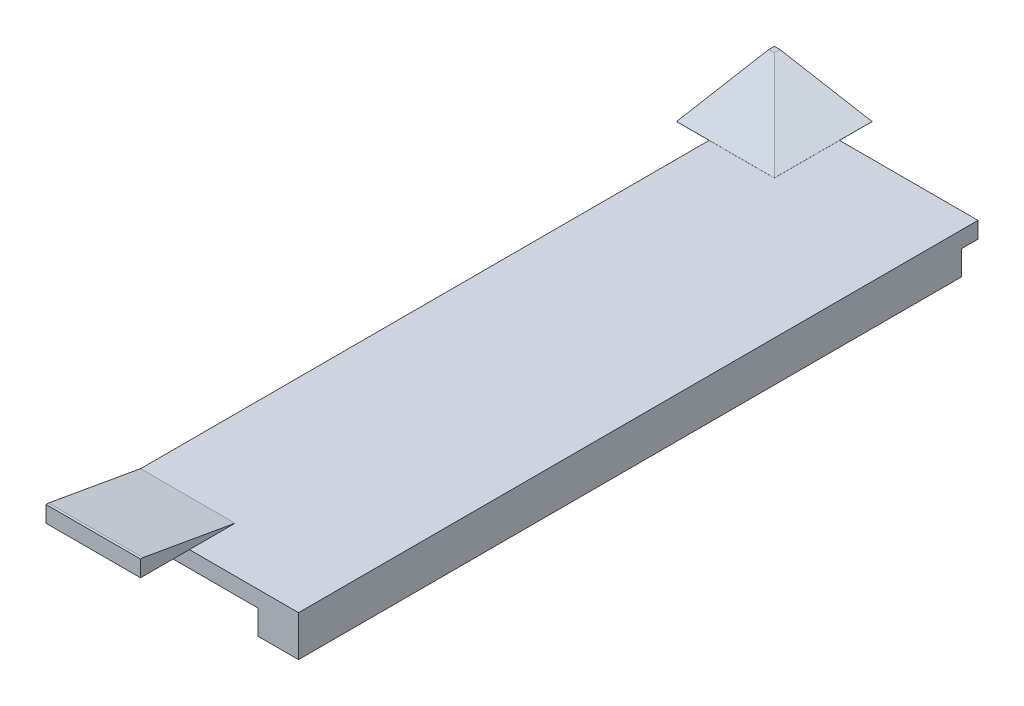
ISO-10303-21;
HEADER;
FILE_DESCRIPTION(('STEP AP214'),'2;1');
FILE_NAME('part.step','',(''),(''),'','','');
FILE_SCHEMA(('AUTOMOTIVE_DESIGN { 1 0 10303 214 1 1 1 1 }'));
ENDSEC;
DATA;
#1=APPLICATION_CONTEXT('core data for automotive mechanical design processes');
#2=APPLICATION_PROTOCOL_DEFINITION('international standard','automotive_design',2000,#1);
#3=PRODUCT_CONTEXT('',#1,'mechanical');
#4=PRODUCT('Part','Part','',(#3));
#5=PRODUCT_RELATED_PRODUCT_CATEGORY('part','',(#4));
#6=PRODUCT_DEFINITION_FORMATION('','',#4);
#7=PRODUCT_DEFINITION_CONTEXT('part definition',#1,'design');
#8=PRODUCT_DEFINITION('design','',#6,#7);
#9=PRODUCT_DEFINITION_SHAPE('','',#8);
#10=(LENGTH_UNIT() NAMED_UNIT(*) SI_UNIT(.MILLI.,.METRE.));
#11=(NAMED_UNIT(*) PLANE_ANGLE_UNIT() SI_UNIT($,.RADIAN.));
#12=(NAMED_UNIT(*) SI_UNIT($,.STERADIAN.) SOLID_ANGLE_UNIT());
#13=UNCERTAINTY_MEASURE_WITH_UNIT(LENGTH_MEASURE(1.E-05),#10,'distance_accuracy_value','');
#14=(GEOMETRIC_REPRESENTATION_CONTEXT(3) GLOBAL_UNCERTAINTY_ASSIGNED_CONTEXT((#13)) GLOBAL_UNIT_ASSIGNED_CONTEXT((#10,
#11,#12)) REPRESENTATION_CONTEXT('',''));
#15=CARTESIAN_POINT('',(0.,0.,0.));
#16=DIRECTION('',(0.,0.,1.));
#17=DIRECTION('',(1.,0.,0.));
#18=AXIS2_PLACEMENT_3D('',#15,#16,#17);
#19=CARTESIAN_POINT('',(0.,2.,0.));
#20=DIRECTION('',(0.,-1.,0.));
#21=DIRECTION('',(0.,0.,-1.));
#22=AXIS2_PLACEMENT_3D('',#19,#20,#21);
#23=PLANE('',#22);
#24=DIRECTION('',(0.,0.,-1.));
#25=VECTOR('',#24,1.);
#26=CARTESIAN_POINT('',(8.,2.,-75.4));
#27=LINE('',#26,#25);
#28=CARTESIAN_POINT('',(8.,2.,-75.4));
#29=VERTEX_POINT('',#28);
#30=CARTESIAN_POINT('',(8.,2.,-83.4));
#31=VERTEX_POINT('',#30);
#32=EDGE_CURVE('E260',#29,#31,#27,.T.);
#33=ORIENTED_EDGE('',*,*,#32,.F.);
#34=DIRECTION('',(1.,0.,0.));
#35=VECTOR('',#34,1.);
#36=CARTESIAN_POINT('',(8.,2.,-75.4));
#37=LINE('',#36,#35);
#38=CARTESIAN_POINT('',(0.,2.,-75.4));
#39=VERTEX_POINT('',#38);
#40=EDGE_CURVE('E252',#39,#29,#37,.T.);
#41=ORIENTED_EDGE('',*,*,#40,.F.);
#42=DIRECTION('',(0.,0.,1.));
#43=VECTOR('',#42,1.);
#44=CARTESIAN_POINT('',(0.,2.,0.));
#45=LINE('',#44,#43);
#46=CARTESIAN_POINT('',(0.,2.,-5.6));
#47=VERTEX_POINT('',#46);
#48=EDGE_CURVE('E315',#39,#47,#45,.T.);
#49=ORIENTED_EDGE('',*,*,#48,.T.);
#50=DIRECTION('',(-1.,0.,0.));
#51=VECTOR('',#50,1.);
#52=CARTESIAN_POINT('',(0.,2.,-5.59999999999999));
#53=LINE('',#52,#51);
#54=CARTESIAN_POINT('',(11.6,2.,-5.6));
#55=VERTEX_POINT('',#54);
#56=EDGE_CURVE('E275',#55,#47,#53,.T.);
#57=ORIENTED_EDGE('',*,*,#56,.F.);
#58=DIRECTION('',(0.,0.,-1.));
#59=VECTOR('',#58,1.);
#60=CARTESIAN_POINT('',(11.6,2.,-5.6));
#61=LINE('',#60,#59);
#62=CARTESIAN_POINT('',(11.6,2.,0.));
#63=VERTEX_POINT('',#62);
#64=EDGE_CURVE('E292',#63,#55,#61,.T.);
#65=ORIENTED_EDGE('',*,*,#64,.F.);
#66=DIRECTION('',(1.,0.,0.));
#67=VECTOR('',#66,1.);
#68=CARTESIAN_POINT('',(0.,2.,0.));
#69=LINE('',#68,#67);
#70=CARTESIAN_POINT('',(25.,2.,0.));
#71=VERTEX_POINT('',#70);
#72=EDGE_CURVE('E314',#63,#71,#69,.T.);
#73=ORIENTED_EDGE('',*,*,#72,.T.);
#74=DIRECTION('',(0.,0.,-1.));
#75=VECTOR('',#74,1.);
#76=CARTESIAN_POINT('',(25.,2.,0.));
#77=LINE('',#76,#75);
#78=CARTESIAN_POINT('',(25.,2.,-83.4));
#79=VERTEX_POINT('',#78);
#80=EDGE_CURVE('E191',#71,#79,#77,.T.);
#81=ORIENTED_EDGE('',*,*,#80,.T.);
#82=DIRECTION('',(-1.,0.,0.));
#83=VECTOR('',#82,1.);
#84=CARTESIAN_POINT('',(0.,2.,-83.4));
#85=LINE('',#84,#83);
#86=EDGE_CURVE('E323',#79,#31,#85,.T.);
#87=ORIENTED_EDGE('',*,*,#86,.T.);
#88=EDGE_LOOP('',(#33,#41,#49,#57,#65,#73,#81,#87));
#89=FACE_BOUND('',#88,.T.);
#90=ADVANCED_FACE('F51',(#89),#23,.F.);
#91=CARTESIAN_POINT('',(0.,2.,0.));
#92=DIRECTION('',(1.,0.,0.));
#93=DIRECTION('',(0.,0.,-1.));
#94=AXIS2_PLACEMENT_3D('',#91,#92,#93);
#95=PLANE('',#94);
#96=DIRECTION('',(0.,0.,1.));
#97=VECTOR('',#96,1.);
#98=CARTESIAN_POINT('',(0.,4.,-5.59999999999999));
#99=LINE('',#98,#97);
#100=CARTESIAN_POINT('',(0.,4.,5.70000000000023));
#101=VERTEX_POINT('',#100);
#102=CARTESIAN_POINT('',(0.,4.,6.));
#103=VERTEX_POINT('',#102);
#104=EDGE_CURVE('E271',#101,#103,#99,.T.);
#105=ORIENTED_EDGE('',*,*,#104,.F.);
#106=DIRECTION('',(0.,-0.173648177666927,-0.984807753012209));
#107=VECTOR('',#106,1.);
#108=CARTESIAN_POINT('',(0.,4.,5.70000000000023));
#109=LINE('',#108,#107);
#110=CARTESIAN_POINT('',(0.,2.00750511799434,-5.59999999999999));
#111=VERTEX_POINT('',#110);
#112=EDGE_CURVE('E371',#101,#111,#109,.T.);
#113=ORIENTED_EDGE('',*,*,#112,.T.);
#114=DIRECTION('',(0.,-1.,0.));
#115=VECTOR('',#114,1.);
#116=CARTESIAN_POINT('',(0.,4.,-5.59999999999999));
#117=LINE('',#116,#115);
#118=EDGE_CURVE('E282',#111,#47,#117,.T.);
#119=ORIENTED_EDGE('',*,*,#118,.T.);
#120=ORIENTED_EDGE('',*,*,#48,.F.);
#121=CARTESIAN_POINT('',(0.,2.,-83.4));
#122=VERTEX_POINT('',#121);
#123=EDGE_CURVE('E310',#122,#39,#45,.T.);
#124=ORIENTED_EDGE('',*,*,#123,.F.);
#125=DIRECTION('',(0.,-1.,0.));
#126=VECTOR('',#125,1.);
#127=CARTESIAN_POINT('',(0.,2.,-83.4));
#128=LINE('',#127,#126);
#129=CARTESIAN_POINT('',(0.,0.,-83.4));
#130=VERTEX_POINT('',#129);
#131=EDGE_CURVE('E327',#122,#130,#128,.T.);
#132=ORIENTED_EDGE('',*,*,#131,.T.);
#133=DIRECTION('',(0.,0.,1.));
#134=VECTOR('',#133,1.);
#135=CARTESIAN_POINT('',(0.,0.,0.));
#136=LINE('',#135,#134);
#137=CARTESIAN_POINT('',(0.,0.,0.));
#138=VERTEX_POINT('',#137);
#139=EDGE_CURVE('E309',#130,#138,#136,.T.);
#140=ORIENTED_EDGE('',*,*,#139,.T.);
#141=DIRECTION('',(0.,-1.,0.));
#142=VECTOR('',#141,1.);
#143=CARTESIAN_POINT('',(0.,2.,0.));
#144=LINE('',#143,#142);
#145=CARTESIAN_POINT('',(0.,2.,0.));
#146=VERTEX_POINT('',#145);
#147=EDGE_CURVE('E195',#146,#138,#144,.T.);
#148=ORIENTED_EDGE('',*,*,#147,.F.);
#149=DIRECTION('',(0.,0.,1.));
#150=VECTOR('',#149,1.);
#151=CARTESIAN_POINT('',(0.,2.,-5.59999999999999));
#152=LINE('',#151,#150);
#153=CARTESIAN_POINT('',(0.,2.,6.));
#154=VERTEX_POINT('',#153);
#155=EDGE_CURVE('E264',#146,#154,#152,.T.);
#156=ORIENTED_EDGE('',*,*,#155,.T.);
#157=DIRECTION('',(0.,-1.,0.));
#158=VECTOR('',#157,1.);
#159=CARTESIAN_POINT('',(0.,4.,6.));
#160=LINE('',#159,#158);
#161=EDGE_CURVE('E305',#103,#154,#160,.T.);
#162=ORIENTED_EDGE('',*,*,#161,.F.);
#163=EDGE_LOOP('',(#105,#113,#119,#120,#124,#132,#140,#148,#156,#162));
#164=FACE_BOUND('',#163,.T.);
#165=ADVANCED_FACE('F394',(#164),#95,.F.);
#166=CARTESIAN_POINT('',(0.,2.,0.));
#167=DIRECTION('',(0.,0.,-1.));
#168=DIRECTION('',(-1.,0.,0.));
#169=AXIS2_PLACEMENT_3D('',#166,#167,#168);
#170=PLANE('',#169);
#171=DIRECTION('',(1.,0.,0.));
#172=VECTOR('',#171,1.);
#173=CARTESIAN_POINT('',(0.,0.,0.));
#174=LINE('',#173,#172);
#175=CARTESIAN_POINT('',(20.,0.,0.));
#176=VERTEX_POINT('',#175);
#177=EDGE_CURVE('E331',#138,#176,#174,.T.);
#178=ORIENTED_EDGE('',*,*,#177,.T.);
#179=DIRECTION('',(0.,1.,0.));
#180=VECTOR('',#179,1.);
#181=CARTESIAN_POINT('',(20.,-3.,0.));
#182=LINE('',#181,#180);
#183=CARTESIAN_POINT('',(20.,-3.,0.));
#184=VERTEX_POINT('',#183);
#185=EDGE_CURVE('E202',#184,#176,#182,.T.);
#186=ORIENTED_EDGE('',*,*,#185,.F.);
#187=DIRECTION('',(-1.,0.,0.));
#188=VECTOR('',#187,1.);
#189=CARTESIAN_POINT('',(25.,-3.,0.));
#190=LINE('',#189,#188);
#191=CARTESIAN_POINT('',(25.,-3.,0.));
#192=VERTEX_POINT('',#191);
#193=EDGE_CURVE('E199',#192,#184,#190,.T.);
#194=ORIENTED_EDGE('',*,*,#193,.F.);
#195=DIRECTION('',(0.,-1.,0.));
#196=VECTOR('',#195,1.);
#197=CARTESIAN_POINT('',(25.,2.,0.));
#198=LINE('',#197,#196);
#199=EDGE_CURVE('E184',#71,#192,#198,.T.);
#200=ORIENTED_EDGE('',*,*,#199,.F.);
#201=ORIENTED_EDGE('',*,*,#72,.F.);
#202=EDGE_CURVE('E316',#146,#63,#69,.T.);
#203=ORIENTED_EDGE('',*,*,#202,.F.);
#204=ORIENTED_EDGE('',*,*,#147,.T.);
#205=EDGE_LOOP('',(#178,#186,#194,#200,#201,#203,#204));
#206=FACE_BOUND('',#205,.T.);
#207=ADVANCED_FACE('F200',(#206),#170,.F.);
#208=CARTESIAN_POINT('',(25.,2.,0.));
#209=DIRECTION('',(-1.,0.,0.));
#210=DIRECTION('',(0.,0.,1.));
#211=AXIS2_PLACEMENT_3D('',#208,#209,#210);
#212=PLANE('',#211);
#213=ORIENTED_EDGE('',*,*,#199,.T.);
#214=DIRECTION('',(0.,0.,1.));
#215=VECTOR('',#214,1.);
#216=CARTESIAN_POINT('',(25.,-3.,-81.4));
#217=LINE('',#216,#215);
#218=CARTESIAN_POINT('',(25.,-3.,-81.4));
#219=VERTEX_POINT('',#218);
#220=EDGE_CURVE('E189',#219,#192,#217,.T.);
#221=ORIENTED_EDGE('',*,*,#220,.F.);
#222=DIRECTION('',(0.,1.,0.));
#223=VECTOR('',#222,1.);
#224=CARTESIAN_POINT('',(25.,-3.,-81.4));
#225=LINE('',#224,#223);
#226=CARTESIAN_POINT('',(25.,0.,-81.4));
#227=VERTEX_POINT('',#226);
#228=EDGE_CURVE('E222',#219,#227,#225,.T.);
#229=ORIENTED_EDGE('',*,*,#228,.T.);
#230=DIRECTION('',(0.,0.,-1.));
#231=VECTOR('',#230,1.);
#232=CARTESIAN_POINT('',(25.,0.,0.));
#233=LINE('',#232,#231);
#234=CARTESIAN_POINT('',(25.,0.,-83.4));
#235=VERTEX_POINT('',#234);
#236=EDGE_CURVE('E75',#227,#235,#233,.T.);
#237=ORIENTED_EDGE('',*,*,#236,.T.);
#238=DIRECTION('',(0.,-1.,0.));
#239=VECTOR('',#238,1.);
#240=CARTESIAN_POINT('',(25.,2.,-83.4));
#241=LINE('',#240,#239);
#242=EDGE_CURVE('E196',#79,#235,#241,.T.);
#243=ORIENTED_EDGE('',*,*,#242,.F.);
#244=ORIENTED_EDGE('',*,*,#80,.F.);
#245=EDGE_LOOP('',(#213,#221,#229,#237,#243,#244));
#246=FACE_BOUND('',#245,.T.);
#247=ADVANCED_FACE('F186',(#246),#212,.F.);
#248=CARTESIAN_POINT('',(0.,2.,-83.4));
#249=DIRECTION('',(0.,0.,1.));
#250=DIRECTION('',(1.,0.,0.));
#251=AXIS2_PLACEMENT_3D('',#248,#249,#250);
#252=PLANE('',#251);
#253=DIRECTION('',(-1.,0.,0.));
#254=VECTOR('',#253,1.);
#255=CARTESIAN_POINT('',(0.,0.,-83.4));
#256=LINE('',#255,#254);
#257=EDGE_CURVE('E336',#235,#130,#256,.T.);
#258=ORIENTED_EDGE('',*,*,#257,.T.);
#259=ORIENTED_EDGE('',*,*,#131,.F.);
#260=EDGE_CURVE('E322',#31,#122,#85,.T.);
#261=ORIENTED_EDGE('',*,*,#260,.F.);
#262=ORIENTED_EDGE('',*,*,#86,.F.);
#263=ORIENTED_EDGE('',*,*,#242,.T.);
#264=EDGE_LOOP('',(#258,#259,#261,#262,#263));
#265=FACE_BOUND('',#264,.T.);
#266=ADVANCED_FACE('F414',(#265),#252,.F.);
#267=CARTESIAN_POINT('',(0.,0.,0.));
#268=DIRECTION('',(0.,-1.,0.));
#269=DIRECTION('',(0.,0.,-1.));
#270=AXIS2_PLACEMENT_3D('',#267,#268,#269);
#271=PLANE('',#270);
#272=DIRECTION('',(1.,0.,0.));
#273=VECTOR('',#272,1.);
#274=CARTESIAN_POINT('',(25.,0.,-81.4));
#275=LINE('',#274,#273);
#276=CARTESIAN_POINT('',(20.,0.,-81.4));
#277=VERTEX_POINT('',#276);
#278=EDGE_CURVE('E213',#277,#227,#275,.T.);
#279=ORIENTED_EDGE('',*,*,#278,.F.);
#280=DIRECTION('',(0.,0.,-1.));
#281=VECTOR('',#280,1.);
#282=CARTESIAN_POINT('',(20.,0.,-81.4));
#283=LINE('',#282,#281);
#284=EDGE_CURVE('E69',#176,#277,#283,.T.);
#285=ORIENTED_EDGE('',*,*,#284,.F.);
#286=ORIENTED_EDGE('',*,*,#177,.F.);
#287=ORIENTED_EDGE('',*,*,#139,.F.);
#288=ORIENTED_EDGE('',*,*,#257,.F.);
#289=ORIENTED_EDGE('',*,*,#236,.F.);
#290=EDGE_LOOP('',(#279,#285,#286,#287,#288,#289));
#291=FACE_BOUND('',#290,.T.);
#292=ADVANCED_FACE('F406',(#291),#271,.T.);
#293=CARTESIAN_POINT('',(0.,2.,0.));
#294=DIRECTION('',(0.,1.,0.));
#295=DIRECTION('',(0.,0.,1.));
#296=AXIS2_PLACEMENT_3D('',#293,#294,#295);
#297=PLANE('',#296);
#298=ORIENTED_EDGE('',*,*,#155,.F.);
#299=ORIENTED_EDGE('',*,*,#202,.T.);
#300=CARTESIAN_POINT('',(11.6,2.,6.));
#301=VERTEX_POINT('',#300);
#302=EDGE_CURVE('E288',#301,#63,#61,.T.);
#303=ORIENTED_EDGE('',*,*,#302,.F.);
#304=DIRECTION('',(1.,0.,0.));
#305=VECTOR('',#304,1.);
#306=CARTESIAN_POINT('',(0.,2.,6.));
#307=LINE('',#306,#305);
#308=EDGE_CURVE('E285',#154,#301,#307,.T.);
#309=ORIENTED_EDGE('',*,*,#308,.F.);
#310=EDGE_LOOP('',(#298,#299,#303,#309));
#311=FACE_BOUND('',#310,.T.);
#312=ADVANCED_FACE('F403',(#311),#297,.F.);
#313=CARTESIAN_POINT('',(0.,4.,6.));
#314=DIRECTION('',(0.,0.,-1.));
#315=DIRECTION('',(-1.,0.,0.));
#316=AXIS2_PLACEMENT_3D('',#313,#314,#315);
#317=PLANE('',#316);
#318=ORIENTED_EDGE('',*,*,#308,.T.);
#319=DIRECTION('',(0.,-1.,0.));
#320=VECTOR('',#319,1.);
#321=CARTESIAN_POINT('',(11.6,4.,6.));
#322=LINE('',#321,#320);
#323=CARTESIAN_POINT('',(11.6,4.,6.));
#324=VERTEX_POINT('',#323);
#325=EDGE_CURVE('E301',#324,#301,#322,.T.);
#326=ORIENTED_EDGE('',*,*,#325,.F.);
#327=DIRECTION('',(1.,0.,0.));
#328=VECTOR('',#327,1.);
#329=CARTESIAN_POINT('',(0.,4.,6.));
#330=LINE('',#329,#328);
#331=EDGE_CURVE('E274',#103,#324,#330,.T.);
#332=ORIENTED_EDGE('',*,*,#331,.F.);
#333=ORIENTED_EDGE('',*,*,#161,.T.);
#334=EDGE_LOOP('',(#318,#326,#332,#333));
#335=FACE_BOUND('',#334,.T.);
#336=ADVANCED_FACE('F399',(#335),#317,.F.);
#337=CARTESIAN_POINT('',(11.6,4.,-5.6));
#338=DIRECTION('',(-1.,0.,0.));
#339=DIRECTION('',(0.,0.,1.));
#340=AXIS2_PLACEMENT_3D('',#337,#338,#339);
#341=PLANE('',#340);
#342=DIRECTION('',(0.,-1.,0.));
#343=VECTOR('',#342,1.);
#344=CARTESIAN_POINT('',(11.6,4.,-5.6));
#345=LINE('',#344,#343);
#346=CARTESIAN_POINT('',(11.6,2.00750511799434,-5.6));
#347=VERTEX_POINT('',#346);
#348=EDGE_CURVE('E298',#347,#55,#345,.T.);
#349=ORIENTED_EDGE('',*,*,#348,.F.);
#350=DIRECTION('',(0.,0.173648177666927,0.984807753012209));
#351=VECTOR('',#350,1.);
#352=CARTESIAN_POINT('',(11.6,4.,5.70000000000023));
#353=LINE('',#352,#351);
#354=CARTESIAN_POINT('',(11.6,4.,5.70000000000023));
#355=VERTEX_POINT('',#354);
#356=EDGE_CURVE('E11',#347,#355,#353,.T.);
#357=ORIENTED_EDGE('',*,*,#356,.T.);
#358=DIRECTION('',(0.,0.,-1.));
#359=VECTOR('',#358,1.);
#360=CARTESIAN_POINT('',(11.6,4.,-5.6));
#361=LINE('',#360,#359);
#362=EDGE_CURVE('E278',#324,#355,#361,.T.);
#363=ORIENTED_EDGE('',*,*,#362,.F.);
#364=ORIENTED_EDGE('',*,*,#325,.T.);
#365=ORIENTED_EDGE('',*,*,#302,.T.);
#366=ORIENTED_EDGE('',*,*,#64,.T.);
#367=EDGE_LOOP('',(#349,#357,#363,#364,#365,#366));
#368=FACE_BOUND('',#367,.T.);
#369=ADVANCED_FACE('F385',(#368),#341,.F.);
#370=CARTESIAN_POINT('',(0.,4.,-5.59999999999999));
#371=DIRECTION('',(0.,0.,1.));
#372=DIRECTION('',(1.,0.,0.));
#373=AXIS2_PLACEMENT_3D('',#370,#371,#372);
#374=PLANE('',#373);
#375=ORIENTED_EDGE('',*,*,#118,.F.);
#376=DIRECTION('',(1.,0.,0.));
#377=VECTOR('',#376,1.);
#378=CARTESIAN_POINT('',(11.6,2.00750511799434,-5.6));
#379=LINE('',#378,#377);
#380=EDGE_CURVE('E62',#111,#347,#379,.T.);
#381=ORIENTED_EDGE('',*,*,#380,.T.);
#382=ORIENTED_EDGE('',*,*,#348,.T.);
#383=ORIENTED_EDGE('',*,*,#56,.T.);
#384=EDGE_LOOP('',(#375,#381,#382,#383));
#385=FACE_BOUND('',#384,.T.);
#386=ADVANCED_FACE('F379',(#385),#374,.F.);
#387=CARTESIAN_POINT('',(0.,4.,0.));
#388=DIRECTION('',(0.,1.,0.));
#389=DIRECTION('',(0.,0.,1.));
#390=AXIS2_PLACEMENT_3D('',#387,#388,#389);
#391=PLANE('',#390);
#392=ORIENTED_EDGE('',*,*,#362,.T.);
#393=DIRECTION('',(-1.,0.,0.));
#394=VECTOR('',#393,1.);
#395=CARTESIAN_POINT('',(0.,4.,5.70000000000023));
#396=LINE('',#395,#394);
#397=EDGE_CURVE('E367',#355,#101,#396,.T.);
#398=ORIENTED_EDGE('',*,*,#397,.T.);
#399=ORIENTED_EDGE('',*,*,#104,.T.);
#400=ORIENTED_EDGE('',*,*,#331,.T.);
#401=EDGE_LOOP('',(#392,#398,#399,#400));
#402=FACE_BOUND('',#401,.T.);
#403=ADVANCED_FACE('F390',(#402),#391,.T.);
#404=CARTESIAN_POINT('',(0.,2.,0.));
#405=DIRECTION('',(0.,1.,0.));
#406=DIRECTION('',(0.,0.,1.));
#407=AXIS2_PLACEMENT_3D('',#404,#405,#406);
#408=PLANE('',#407);
#409=ORIENTED_EDGE('',*,*,#260,.T.);
#410=ORIENTED_EDGE('',*,*,#123,.T.);
#411=CARTESIAN_POINT('',(-4.,2.,-75.4));
#412=VERTEX_POINT('',#411);
#413=EDGE_CURVE('E247',#412,#39,#37,.T.);
#414=ORIENTED_EDGE('',*,*,#413,.F.);
#415=DIRECTION('',(0.,0.,1.));
#416=VECTOR('',#415,1.);
#417=CARTESIAN_POINT('',(-4.,2.,-75.4));
#418=LINE('',#417,#416);
#419=CARTESIAN_POINT('',(-4.,2.,-87.4));
#420=VERTEX_POINT('',#419);
#421=EDGE_CURVE('E251',#420,#412,#418,.T.);
#422=ORIENTED_EDGE('',*,*,#421,.F.);
#423=DIRECTION('',(-1.,0.,0.));
#424=VECTOR('',#423,1.);
#425=CARTESIAN_POINT('',(8.,2.,-87.4));
#426=LINE('',#425,#424);
#427=CARTESIAN_POINT('',(8.,2.,-87.4));
#428=VERTEX_POINT('',#427);
#429=EDGE_CURVE('E256',#428,#420,#426,.T.);
#430=ORIENTED_EDGE('',*,*,#429,.F.);
#431=EDGE_CURVE('E259',#31,#428,#27,.T.);
#432=ORIENTED_EDGE('',*,*,#431,.F.);
#433=EDGE_LOOP('',(#409,#410,#414,#422,#430,#432));
#434=FACE_BOUND('',#433,.T.);
#435=ADVANCED_FACE('F423',(#434),#408,.F.);
#436=CARTESIAN_POINT('',(8.,4.,-75.4));
#437=DIRECTION('',(-1.,0.,0.));
#438=DIRECTION('',(0.,0.,1.));
#439=AXIS2_PLACEMENT_3D('',#436,#437,#438);
#440=PLANE('',#439);
#441=DIRECTION('',(0.,-1.,0.));
#442=VECTOR('',#441,1.);
#443=CARTESIAN_POINT('',(8.,4.,-87.4));
#444=LINE('',#443,#442);
#445=CARTESIAN_POINT('',(8.,2.00750511799434,-87.4));
#446=VERTEX_POINT('',#445);
#447=EDGE_CURVE('E233',#446,#428,#444,.T.);
#448=ORIENTED_EDGE('',*,*,#447,.F.);
#449=DIRECTION('',(0.,0.,1.));
#450=VECTOR('',#449,1.);
#451=CARTESIAN_POINT('',(8.,2.00750511799434,-75.4));
#452=LINE('',#451,#450);
#453=CARTESIAN_POINT('',(8.,2.00750511799434,-75.4));
#454=VERTEX_POINT('',#453);
#455=EDGE_CURVE('E358',#446,#454,#452,.T.);
#456=ORIENTED_EDGE('',*,*,#455,.T.);
#457=DIRECTION('',(0.,-1.,0.));
#458=VECTOR('',#457,1.);
#459=CARTESIAN_POINT('',(8.,4.,-75.4));
#460=LINE('',#459,#458);
#461=EDGE_CURVE('E243',#454,#29,#460,.T.);
#462=ORIENTED_EDGE('',*,*,#461,.T.);
#463=ORIENTED_EDGE('',*,*,#32,.T.);
#464=ORIENTED_EDGE('',*,*,#431,.T.);
#465=EDGE_LOOP('',(#448,#456,#462,#463,#464));
#466=FACE_BOUND('',#465,.T.);
#467=ADVANCED_FACE('F428',(#466),#440,.F.);
#468=CARTESIAN_POINT('',(8.,4.,-87.4));
#469=DIRECTION('',(0.,0.,1.));
#470=DIRECTION('',(1.,0.,0.));
#471=AXIS2_PLACEMENT_3D('',#468,#469,#470);
#472=PLANE('',#471);
#473=DIRECTION('',(-1.,0.,0.));
#474=VECTOR('',#473,1.);
#475=CARTESIAN_POINT('',(8.,4.,-87.4));
#476=LINE('',#475,#474);
#477=CARTESIAN_POINT('',(-3.30000000000023,4.,-87.4));
#478=VERTEX_POINT('',#477);
#479=CARTESIAN_POINT('',(-4.,4.,-87.4));
#480=VERTEX_POINT('',#479);
#481=EDGE_CURVE('E268',#478,#480,#476,.T.);
#482=ORIENTED_EDGE('',*,*,#481,.F.);
#483=DIRECTION('',(0.984807753012209,-0.173648177666927,0.));
#484=VECTOR('',#483,1.);
#485=CARTESIAN_POINT('',(-3.30000000000023,4.,-87.4));
#486=LINE('',#485,#484);
#487=EDGE_CURVE('E355',#478,#446,#486,.T.);
#488=ORIENTED_EDGE('',*,*,#487,.T.);
#489=ORIENTED_EDGE('',*,*,#447,.T.);
#490=ORIENTED_EDGE('',*,*,#429,.T.);
#491=DIRECTION('',(0.,-1.,0.));
#492=VECTOR('',#491,1.);
#493=CARTESIAN_POINT('',(-4.,4.,-87.4));
#494=LINE('',#493,#492);
#495=EDGE_CURVE('E236',#480,#420,#494,.T.);
#496=ORIENTED_EDGE('',*,*,#495,.F.);
#497=EDGE_LOOP('',(#482,#488,#489,#490,#496));
#498=FACE_BOUND('',#497,.T.);
#499=ADVANCED_FACE('F459',(#498),#472,.F.);
#500=CARTESIAN_POINT('',(-4.,4.,-75.4));
#501=DIRECTION('',(1.,0.,0.));
#502=DIRECTION('',(0.,0.,-1.));
#503=AXIS2_PLACEMENT_3D('',#500,#501,#502);
#504=PLANE('',#503);
#505=DIRECTION('',(0.,-1.,0.));
#506=VECTOR('',#505,1.);
#507=CARTESIAN_POINT('',(-4.,4.,-75.4));
#508=LINE('',#507,#506);
#509=CARTESIAN_POINT('',(-4.,2.00750511799434,-75.4));
#510=VERTEX_POINT('',#509);
#511=EDGE_CURVE('E240',#510,#412,#508,.T.);
#512=ORIENTED_EDGE('',*,*,#511,.F.);
#513=DIRECTION('',(0.,0.173648177666927,-0.984807753012209));
#514=VECTOR('',#513,1.);
#515=CARTESIAN_POINT('',(-4.,4.,-86.7000000000002));
#516=LINE('',#515,#514);
#517=CARTESIAN_POINT('',(-4.,4.,-86.7000000000002));
#518=VERTEX_POINT('',#517);
#519=EDGE_CURVE('E364',#510,#518,#516,.T.);
#520=ORIENTED_EDGE('',*,*,#519,.T.);
#521=DIRECTION('',(0.,0.,1.));
#522=VECTOR('',#521,1.);
#523=CARTESIAN_POINT('',(-4.,4.,-75.4));
#524=LINE('',#523,#522);
#525=EDGE_CURVE('E246',#480,#518,#524,.T.);
#526=ORIENTED_EDGE('',*,*,#525,.F.);
#527=ORIENTED_EDGE('',*,*,#495,.T.);
#528=ORIENTED_EDGE('',*,*,#421,.T.);
#529=EDGE_LOOP('',(#512,#520,#526,#527,#528));
#530=FACE_BOUND('',#529,.T.);
#531=ADVANCED_FACE('F454',(#530),#504,.F.);
#532=CARTESIAN_POINT('',(8.,4.,-75.4));
#533=DIRECTION('',(0.,0.,-1.));
#534=DIRECTION('',(-1.,0.,0.));
#535=AXIS2_PLACEMENT_3D('',#532,#533,#534);
#536=PLANE('',#535);
#537=ORIENTED_EDGE('',*,*,#461,.F.);
#538=DIRECTION('',(-1.,0.,0.));
#539=VECTOR('',#538,1.);
#540=CARTESIAN_POINT('',(-4.,2.00750511799434,-75.4));
#541=LINE('',#540,#539);
#542=EDGE_CURVE('E361',#454,#510,#541,.T.);
#543=ORIENTED_EDGE('',*,*,#542,.T.);
#544=ORIENTED_EDGE('',*,*,#511,.T.);
#545=ORIENTED_EDGE('',*,*,#413,.T.);
#546=ORIENTED_EDGE('',*,*,#40,.T.);
#547=EDGE_LOOP('',(#537,#543,#544,#545,#546));
#548=FACE_BOUND('',#547,.T.);
#549=ADVANCED_FACE('F433',(#548),#536,.F.);
#550=CARTESIAN_POINT('',(0.,4.,0.));
#551=DIRECTION('',(0.,1.,0.));
#552=DIRECTION('',(0.,0.,1.));
#553=AXIS2_PLACEMENT_3D('',#550,#551,#552);
#554=PLANE('',#553);
#555=DIRECTION('',(1.,0.,0.));
#556=VECTOR('',#555,1.);
#557=CARTESIAN_POINT('',(8.,4.,-86.7000000000002));
#558=LINE('',#557,#556);
#559=CARTESIAN_POINT('',(-3.30000000000023,4.,-86.7000000000002));
#560=VERTEX_POINT('',#559);
#561=EDGE_CURVE('E348',#518,#560,#558,.T.);
#562=ORIENTED_EDGE('',*,*,#561,.T.);
#563=DIRECTION('',(0.,0.,-1.));
#564=VECTOR('',#563,1.);
#565=CARTESIAN_POINT('',(-3.30000000000023,4.,-87.4));
#566=LINE('',#565,#564);
#567=EDGE_CURVE('E351',#560,#478,#566,.T.);
#568=ORIENTED_EDGE('',*,*,#567,.T.);
#569=ORIENTED_EDGE('',*,*,#481,.T.);
#570=ORIENTED_EDGE('',*,*,#525,.T.);
#571=EDGE_LOOP('',(#562,#568,#569,#570));
#572=FACE_BOUND('',#571,.T.);
#573=ADVANCED_FACE('F461',(#572),#554,.T.);
#574=CARTESIAN_POINT('',(0.,4.,-86.7000000000002));
#575=DIRECTION('',(0.,0.984807753012209,0.173648177666927));
#576=DIRECTION('',(-1.,0.,0.));
#577=AXIS2_PLACEMENT_3D('',#574,#575,#576);
#578=PLANE('',#577);
#579=ORIENTED_EDGE('',*,*,#519,.F.);
#580=ORIENTED_EDGE('',*,*,#542,.F.);
#581=DIRECTION('',(-0.701673843159863,0.123724030206481,-0.701673843159863));
#582=VECTOR('',#581,1.);
#583=CARTESIAN_POINT('',(-1.6752575988235,3.71351407797149,-85.0752575988235));
#584=LINE('',#583,#582);
#585=EDGE_CURVE('E56',#560,#454,#584,.F.);
#586=ORIENTED_EDGE('',*,*,#585,.F.);
#587=ORIENTED_EDGE('',*,*,#561,.F.);
#588=EDGE_LOOP('',(#579,#580,#586,#587));
#589=FACE_BOUND('',#588,.T.);
#590=ADVANCED_FACE('F439',(#589),#578,.T.);
#591=CARTESIAN_POINT('',(-3.30000000000023,4.,0.));
#592=DIRECTION('',(0.173648177666927,0.984807753012209,0.));
#593=DIRECTION('',(0.,0.,1.));
#594=AXIS2_PLACEMENT_3D('',#591,#592,#593);
#595=PLANE('',#594);
#596=ORIENTED_EDGE('',*,*,#585,.T.);
#597=ORIENTED_EDGE('',*,*,#455,.F.);
#598=ORIENTED_EDGE('',*,*,#487,.F.);
#599=ORIENTED_EDGE('',*,*,#567,.F.);
#600=EDGE_LOOP('',(#596,#597,#598,#599));
#601=FACE_BOUND('',#600,.T.);
#602=ADVANCED_FACE('F443',(#601),#595,.T.);
#603=CARTESIAN_POINT('',(0.,4.,5.70000000000023));
#604=DIRECTION('',(0.,0.984807753012209,-0.173648177666927));
#605=DIRECTION('',(1.,0.,0.));
#606=AXIS2_PLACEMENT_3D('',#603,#604,#605);
#607=PLANE('',#606);
#608=ORIENTED_EDGE('',*,*,#356,.F.);
#609=ORIENTED_EDGE('',*,*,#380,.F.);
#610=ORIENTED_EDGE('',*,*,#112,.F.);
#611=ORIENTED_EDGE('',*,*,#397,.F.);
#612=EDGE_LOOP('',(#608,#609,#610,#611));
#613=FACE_BOUND('',#612,.T.);
#614=ADVANCED_FACE('F54',(#613),#607,.T.);
#615=CARTESIAN_POINT('',(20.,-3.,-81.4));
#616=DIRECTION('',(1.,0.,0.));
#617=DIRECTION('',(0.,0.,-1.));
#618=AXIS2_PLACEMENT_3D('',#615,#616,#617);
#619=PLANE('',#618);
#620=ORIENTED_EDGE('',*,*,#284,.T.);
#621=DIRECTION('',(0.,1.,0.));
#622=VECTOR('',#621,1.);
#623=CARTESIAN_POINT('',(20.,-3.,-81.4));
#624=LINE('',#623,#622);
#625=CARTESIAN_POINT('',(20.,-3.,-81.4));
#626=VERTEX_POINT('',#625);
#627=EDGE_CURVE('E227',#626,#277,#624,.T.);
#628=ORIENTED_EDGE('',*,*,#627,.F.);
#629=DIRECTION('',(0.,0.,-1.));
#630=VECTOR('',#629,1.);
#631=CARTESIAN_POINT('',(20.,-3.,-81.4));
#632=LINE('',#631,#630);
#633=EDGE_CURVE('E206',#184,#626,#632,.T.);
#634=ORIENTED_EDGE('',*,*,#633,.F.);
#635=ORIENTED_EDGE('',*,*,#185,.T.);
#636=EDGE_LOOP('',(#620,#628,#634,#635));
#637=FACE_BOUND('',#636,.T.);
#638=ADVANCED_FACE('F408',(#637),#619,.F.);
#639=CARTESIAN_POINT('',(25.,-3.,-81.4));
#640=DIRECTION('',(0.,0.,1.));
#641=DIRECTION('',(1.,0.,0.));
#642=AXIS2_PLACEMENT_3D('',#639,#640,#641);
#643=PLANE('',#642);
#644=ORIENTED_EDGE('',*,*,#278,.T.);
#645=ORIENTED_EDGE('',*,*,#228,.F.);
#646=DIRECTION('',(1.,0.,0.));
#647=VECTOR('',#646,1.);
#648=CARTESIAN_POINT('',(25.,-3.,-81.4));
#649=LINE('',#648,#647);
#650=EDGE_CURVE('E210',#626,#219,#649,.T.);
#651=ORIENTED_EDGE('',*,*,#650,.F.);
#652=ORIENTED_EDGE('',*,*,#627,.T.);
#653=EDGE_LOOP('',(#644,#645,#651,#652));
#654=FACE_BOUND('',#653,.T.);
#655=ADVANCED_FACE('F411',(#654),#643,.F.);
#656=CARTESIAN_POINT('',(0.,-3.,0.));
#657=DIRECTION('',(0.,-1.,0.));
#658=DIRECTION('',(0.,0.,-1.));
#659=AXIS2_PLACEMENT_3D('',#656,#657,#658);
#660=PLANE('',#659);
#661=ORIENTED_EDGE('',*,*,#220,.T.);
#662=ORIENTED_EDGE('',*,*,#193,.T.);
#663=ORIENTED_EDGE('',*,*,#633,.T.);
#664=ORIENTED_EDGE('',*,*,#650,.T.);
#665=EDGE_LOOP('',(#661,#662,#663,#664));
#666=FACE_BOUND('',#665,.T.);
#667=ADVANCED_FACE('F208',(#666),#660,.T.);
#668=CLOSED_SHELL('',(#90,#165,#207,#247,#266,#292,#312,#336,#369,#386,#403,#435,#467,#499,#531,
#549,#573,#590,#602,#614,#638,#655,#667));
#669=MANIFOLD_SOLID_BREP('B2',#668);
#670=ADVANCED_BREP_SHAPE_REPRESENTATION('',(#18,#669),#14);
#671=SHAPE_DEFINITION_REPRESENTATION(#9,#670);
ENDSEC;
END-ISO-10303-21;
